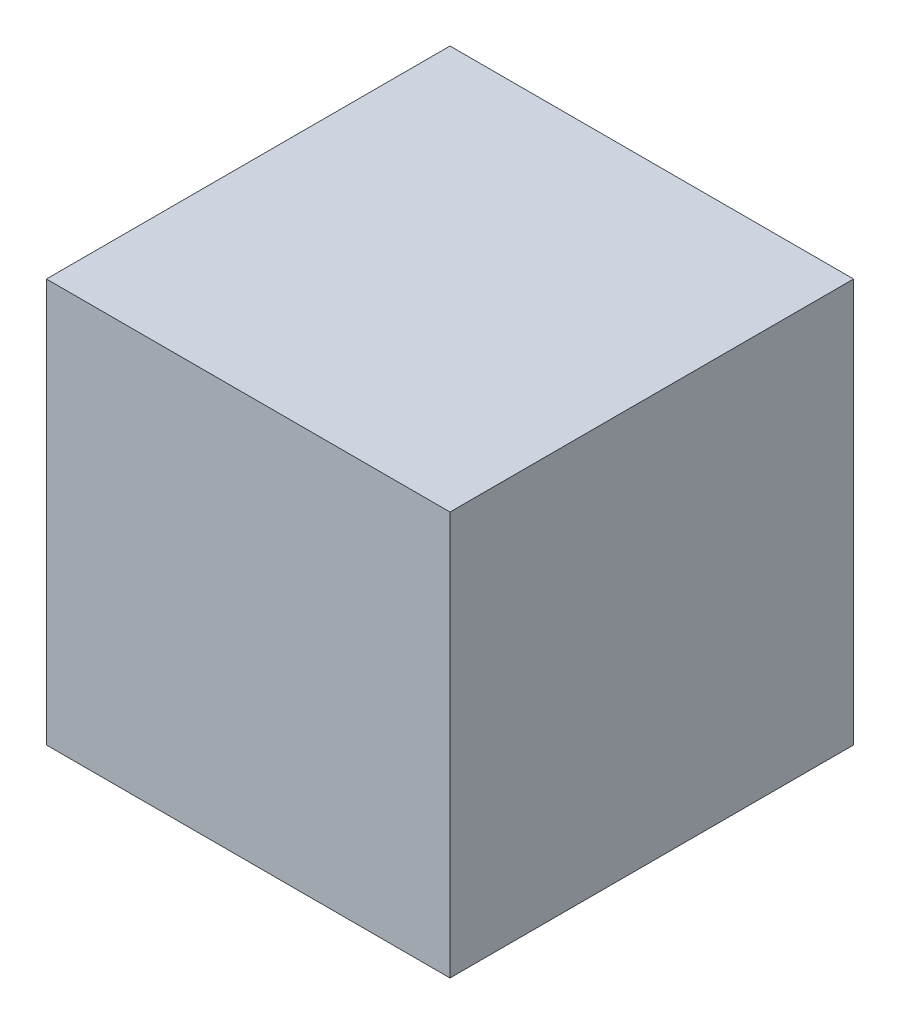
ISO-10303-21;
HEADER;
FILE_DESCRIPTION(('STEP AP214'),'2;1');
FILE_NAME('part.step','',(''),(''),'','','');
FILE_SCHEMA(('AUTOMOTIVE_DESIGN { 1 0 10303 214 1 1 1 1 }'));
ENDSEC;
DATA;
#1=APPLICATION_CONTEXT('core data for automotive mechanical design processes');
#2=APPLICATION_PROTOCOL_DEFINITION('international standard','automotive_design',2000,#1);
#3=PRODUCT_CONTEXT('',#1,'mechanical');
#4=PRODUCT('Part','Part','',(#3));
#5=PRODUCT_RELATED_PRODUCT_CATEGORY('part','',(#4));
#6=PRODUCT_DEFINITION_FORMATION('','',#4);
#7=PRODUCT_DEFINITION_CONTEXT('part definition',#1,'design');
#8=PRODUCT_DEFINITION('design','',#6,#7);
#9=PRODUCT_DEFINITION_SHAPE('','',#8);
#10=(LENGTH_UNIT() NAMED_UNIT(*) SI_UNIT(.MILLI.,.METRE.));
#11=(NAMED_UNIT(*) PLANE_ANGLE_UNIT() SI_UNIT($,.RADIAN.));
#12=(NAMED_UNIT(*) SI_UNIT($,.STERADIAN.) SOLID_ANGLE_UNIT());
#13=UNCERTAINTY_MEASURE_WITH_UNIT(LENGTH_MEASURE(1.E-05),#10,'distance_accuracy_value','');
#14=(GEOMETRIC_REPRESENTATION_CONTEXT(3) GLOBAL_UNCERTAINTY_ASSIGNED_CONTEXT((#13)) GLOBAL_UNIT_ASSIGNED_CONTEXT((#10,
#11,#12)) REPRESENTATION_CONTEXT('',''));
#15=CARTESIAN_POINT('',(0.,0.,0.));
#16=DIRECTION('',(0.,0.,1.));
#17=DIRECTION('',(1.,0.,0.));
#18=AXIS2_PLACEMENT_3D('',#15,#16,#17);
#19=CARTESIAN_POINT('',(0.,130.,0.));
#20=DIRECTION('',(1.,0.,0.));
#21=DIRECTION('',(0.,0.,-1.));
#22=AXIS2_PLACEMENT_3D('',#19,#20,#21);
#23=PLANE('',#22);
#24=DIRECTION('',(0.,0.,1.));
#25=VECTOR('',#24,1.);
#26=CARTESIAN_POINT('',(0.,0.,0.));
#27=LINE('',#26,#25);
#28=CARTESIAN_POINT('',(0.,0.,-130.));
#29=VERTEX_POINT('',#28);
#30=CARTESIAN_POINT('',(0.,0.,0.));
#31=VERTEX_POINT('',#30);
#32=EDGE_CURVE('E95',#29,#31,#27,.T.);
#33=ORIENTED_EDGE('',*,*,#32,.T.);
#34=DIRECTION('',(0.,-1.,0.));
#35=VECTOR('',#34,1.);
#36=CARTESIAN_POINT('',(0.,130.,0.));
#37=LINE('',#36,#35);
#38=CARTESIAN_POINT('',(0.,130.,0.));
#39=VERTEX_POINT('',#38);
#40=EDGE_CURVE('E11',#39,#31,#37,.T.);
#41=ORIENTED_EDGE('',*,*,#40,.F.);
#42=DIRECTION('',(0.,0.,1.));
#43=VECTOR('',#42,1.);
#44=CARTESIAN_POINT('',(0.,130.,0.));
#45=LINE('',#44,#43);
#46=CARTESIAN_POINT('',(0.,130.,-130.));
#47=VERTEX_POINT('',#46);
#48=EDGE_CURVE('E83',#47,#39,#45,.T.);
#49=ORIENTED_EDGE('',*,*,#48,.F.);
#50=DIRECTION('',(0.,-1.,0.));
#51=VECTOR('',#50,1.);
#52=CARTESIAN_POINT('',(0.,130.,-130.));
#53=LINE('',#52,#51);
#54=EDGE_CURVE('E91',#47,#29,#53,.T.);
#55=ORIENTED_EDGE('',*,*,#54,.T.);
#56=EDGE_LOOP('',(#33,#41,#49,#55));
#57=FACE_BOUND('',#56,.T.);
#58=ADVANCED_FACE('F32',(#57),#23,.F.);
#59=CARTESIAN_POINT('',(0.,130.,0.));
#60=DIRECTION('',(0.,0.,-1.));
#61=DIRECTION('',(-1.,0.,0.));
#62=AXIS2_PLACEMENT_3D('',#59,#60,#61);
#63=PLANE('',#62);
#64=DIRECTION('',(1.,0.,0.));
#65=VECTOR('',#64,1.);
#66=CARTESIAN_POINT('',(0.,0.,0.));
#67=LINE('',#66,#65);
#68=CARTESIAN_POINT('',(130.,0.,0.));
#69=VERTEX_POINT('',#68);
#70=EDGE_CURVE('E87',#31,#69,#67,.T.);
#71=ORIENTED_EDGE('',*,*,#70,.T.);
#72=DIRECTION('',(0.,-1.,0.));
#73=VECTOR('',#72,1.);
#74=CARTESIAN_POINT('',(130.,130.,0.));
#75=LINE('',#74,#73);
#76=CARTESIAN_POINT('',(130.,130.,0.));
#77=VERTEX_POINT('',#76);
#78=EDGE_CURVE('E40',#77,#69,#75,.T.);
#79=ORIENTED_EDGE('',*,*,#78,.F.);
#80=DIRECTION('',(1.,0.,0.));
#81=VECTOR('',#80,1.);
#82=CARTESIAN_POINT('',(0.,130.,0.));
#83=LINE('',#82,#81);
#84=EDGE_CURVE('E78',#39,#77,#83,.T.);
#85=ORIENTED_EDGE('',*,*,#84,.F.);
#86=ORIENTED_EDGE('',*,*,#40,.T.);
#87=EDGE_LOOP('',(#71,#79,#85,#86));
#88=FACE_BOUND('',#87,.T.);
#89=ADVANCED_FACE('F86',(#88),#63,.F.);
#90=CARTESIAN_POINT('',(130.,130.,0.));
#91=DIRECTION('',(-1.,0.,0.));
#92=DIRECTION('',(0.,0.,1.));
#93=AXIS2_PLACEMENT_3D('',#90,#91,#92);
#94=PLANE('',#93);
#95=DIRECTION('',(0.,0.,-1.));
#96=VECTOR('',#95,1.);
#97=CARTESIAN_POINT('',(130.,0.,0.));
#98=LINE('',#97,#96);
#99=CARTESIAN_POINT('',(130.,0.,-130.));
#100=VERTEX_POINT('',#99);
#101=EDGE_CURVE('E65',#69,#100,#98,.T.);
#102=ORIENTED_EDGE('',*,*,#101,.T.);
#103=DIRECTION('',(0.,-1.,0.));
#104=VECTOR('',#103,1.);
#105=CARTESIAN_POINT('',(130.,130.,-130.));
#106=LINE('',#105,#104);
#107=CARTESIAN_POINT('',(130.,130.,-130.));
#108=VERTEX_POINT('',#107);
#109=EDGE_CURVE('E88',#108,#100,#106,.T.);
#110=ORIENTED_EDGE('',*,*,#109,.F.);
#111=DIRECTION('',(0.,0.,-1.));
#112=VECTOR('',#111,1.);
#113=CARTESIAN_POINT('',(130.,130.,0.));
#114=LINE('',#113,#112);
#115=EDGE_CURVE('E81',#77,#108,#114,.T.);
#116=ORIENTED_EDGE('',*,*,#115,.F.);
#117=ORIENTED_EDGE('',*,*,#78,.T.);
#118=EDGE_LOOP('',(#102,#110,#116,#117));
#119=FACE_BOUND('',#118,.T.);
#120=ADVANCED_FACE('F89',(#119),#94,.F.);
#121=CARTESIAN_POINT('',(0.,130.,-130.));
#122=DIRECTION('',(0.,0.,1.));
#123=DIRECTION('',(1.,0.,0.));
#124=AXIS2_PLACEMENT_3D('',#121,#122,#123);
#125=PLANE('',#124);
#126=DIRECTION('',(-1.,0.,0.));
#127=VECTOR('',#126,1.);
#128=CARTESIAN_POINT('',(0.,0.,-130.));
#129=LINE('',#128,#127);
#130=EDGE_CURVE('E71',#100,#29,#129,.T.);
#131=ORIENTED_EDGE('',*,*,#130,.T.);
#132=ORIENTED_EDGE('',*,*,#54,.F.);
#133=DIRECTION('',(-1.,0.,0.));
#134=VECTOR('',#133,1.);
#135=CARTESIAN_POINT('',(0.,130.,-130.));
#136=LINE('',#135,#134);
#137=EDGE_CURVE('E48',#108,#47,#136,.T.);
#138=ORIENTED_EDGE('',*,*,#137,.F.);
#139=ORIENTED_EDGE('',*,*,#109,.T.);
#140=EDGE_LOOP('',(#131,#132,#138,#139));
#141=FACE_BOUND('',#140,.T.);
#142=ADVANCED_FACE('F102',(#141),#125,.F.);
#143=CARTESIAN_POINT('',(0.,130.,0.));
#144=DIRECTION('',(0.,-1.,0.));
#145=DIRECTION('',(0.,0.,-1.));
#146=AXIS2_PLACEMENT_3D('',#143,#144,#145);
#147=PLANE('',#146);
#148=ORIENTED_EDGE('',*,*,#48,.T.);
#149=ORIENTED_EDGE('',*,*,#84,.T.);
#150=ORIENTED_EDGE('',*,*,#115,.T.);
#151=ORIENTED_EDGE('',*,*,#137,.T.);
#152=EDGE_LOOP('',(#148,#149,#150,#151));
#153=FACE_BOUND('',#152,.T.);
#154=ADVANCED_FACE('F79',(#153),#147,.F.);
#155=CARTESIAN_POINT('',(0.,0.,0.));
#156=DIRECTION('',(0.,-1.,0.));
#157=DIRECTION('',(0.,0.,-1.));
#158=AXIS2_PLACEMENT_3D('',#155,#156,#157);
#159=PLANE('',#158);
#160=ORIENTED_EDGE('',*,*,#32,.F.);
#161=ORIENTED_EDGE('',*,*,#130,.F.);
#162=ORIENTED_EDGE('',*,*,#101,.F.);
#163=ORIENTED_EDGE('',*,*,#70,.F.);
#164=EDGE_LOOP('',(#160,#161,#162,#163));
#165=FACE_BOUND('',#164,.T.);
#166=ADVANCED_FACE('F105',(#165),#159,.T.);
#167=CLOSED_SHELL('',(#58,#89,#120,#142,#154,#166));
#168=MANIFOLD_SOLID_BREP('B2',#167);
#169=ADVANCED_BREP_SHAPE_REPRESENTATION('',(#18,#168),#14);
#170=SHAPE_DEFINITION_REPRESENTATION(#9,#169);
ENDSEC;
END-ISO-10303-21;
